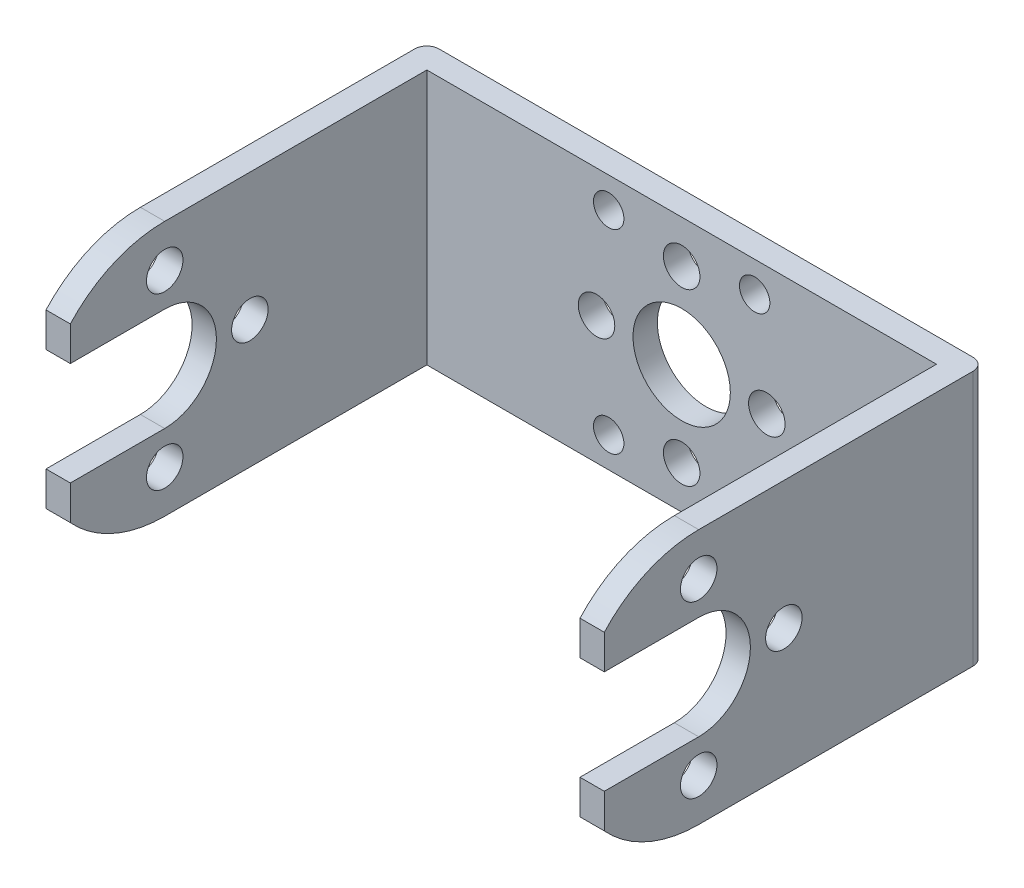
ISO-10303-21;
HEADER;
FILE_DESCRIPTION(('STEP AP214'),'2;1');
FILE_NAME('part.step','',(''),(''),'','','');
FILE_SCHEMA(('AUTOMOTIVE_DESIGN { 1 0 10303 214 1 1 1 1 }'));
ENDSEC;
DATA;
#1=APPLICATION_CONTEXT('core data for automotive mechanical design processes');
#2=APPLICATION_PROTOCOL_DEFINITION('international standard','automotive_design',2000,#1);
#3=PRODUCT_CONTEXT('',#1,'mechanical');
#4=PRODUCT('Part','Part','',(#3));
#5=PRODUCT_RELATED_PRODUCT_CATEGORY('part','',(#4));
#6=PRODUCT_DEFINITION_FORMATION('','',#4);
#7=PRODUCT_DEFINITION_CONTEXT('part definition',#1,'design');
#8=PRODUCT_DEFINITION('design','',#6,#7);
#9=PRODUCT_DEFINITION_SHAPE('','',#8);
#10=(LENGTH_UNIT() NAMED_UNIT(*) SI_UNIT(.MILLI.,.METRE.));
#11=(NAMED_UNIT(*) PLANE_ANGLE_UNIT() SI_UNIT($,.RADIAN.));
#12=(NAMED_UNIT(*) SI_UNIT($,.STERADIAN.) SOLID_ANGLE_UNIT());
#13=UNCERTAINTY_MEASURE_WITH_UNIT(LENGTH_MEASURE(1.E-05),#10,'distance_accuracy_value','');
#14=(GEOMETRIC_REPRESENTATION_CONTEXT(3) GLOBAL_UNCERTAINTY_ASSIGNED_CONTEXT((#13)) GLOBAL_UNIT_ASSIGNED_CONTEXT((#10,
#11,#12)) REPRESENTATION_CONTEXT('',''));
#15=CARTESIAN_POINT('',(0.,0.,0.));
#16=DIRECTION('',(0.,0.,1.));
#17=DIRECTION('',(1.,0.,0.));
#18=AXIS2_PLACEMENT_3D('',#15,#16,#17);
#19=CARTESIAN_POINT('',(-20.95,0.,31.31));
#20=DIRECTION('',(1.,0.,0.));
#21=DIRECTION('',(0.,0.,-1.));
#22=AXIS2_PLACEMENT_3D('',#19,#20,#21);
#23=PLANE('',#22);
#24=CARTESIAN_POINT('',(-20.95,0.,16.55));
#25=DIRECTION('',(1.,0.,0.));
#26=DIRECTION('',(0.,0.,-1.));
#27=AXIS2_PLACEMENT_3D('',#24,#25,#26);
#28=CIRCLE('',#27,1.5);
#29=CARTESIAN_POINT('',(-20.95,0.,15.05));
#30=VERTEX_POINT('',#29);
#31=EDGE_CURVE('E346',#30,#30,#28,.T.);
#32=ORIENTED_EDGE('',*,*,#31,.F.);
#33=EDGE_LOOP('',(#32));
#34=FACE_BOUND('',#33,.T.);
#35=CARTESIAN_POINT('',(-20.95,7.,23.55));
#36=DIRECTION('',(1.,0.,0.));
#37=DIRECTION('',(0.,0.,-1.));
#38=AXIS2_PLACEMENT_3D('',#35,#36,#37);
#39=CIRCLE('',#38,1.5);
#40=CARTESIAN_POINT('',(-20.95,7.,22.05));
#41=VERTEX_POINT('',#40);
#42=EDGE_CURVE('E339',#41,#41,#39,.T.);
#43=ORIENTED_EDGE('',*,*,#42,.F.);
#44=EDGE_LOOP('',(#43));
#45=FACE_BOUND('',#44,.T.);
#46=CARTESIAN_POINT('',(-20.95,-7.,23.55));
#47=DIRECTION('',(1.,0.,0.));
#48=DIRECTION('',(0.,0.,-1.));
#49=AXIS2_PLACEMENT_3D('',#46,#47,#48);
#50=CIRCLE('',#49,1.5);
#51=CARTESIAN_POINT('',(-20.95,-7.,22.05));
#52=VERTEX_POINT('',#51);
#53=EDGE_CURVE('E328',#52,#52,#50,.T.);
#54=ORIENTED_EDGE('',*,*,#53,.F.);
#55=EDGE_LOOP('',(#54));
#56=FACE_BOUND('',#55,.T.);
#57=DIRECTION('',(0.,0.,-1.));
#58=VECTOR('',#57,1.);
#59=CARTESIAN_POINT('',(-20.95,10.5,31.31));
#60=LINE('',#59,#58);
#61=CARTESIAN_POINT('',(-20.95,10.5,23.55));
#62=VERTEX_POINT('',#61);
#63=CARTESIAN_POINT('',(-20.95,10.5,2.));
#64=VERTEX_POINT('',#63);
#65=EDGE_CURVE('E380',#62,#64,#60,.T.);
#66=ORIENTED_EDGE('',*,*,#65,.F.);
#67=CARTESIAN_POINT('',(-20.95,0.,23.55));
#68=DIRECTION('',(1.,0.,0.));
#69=DIRECTION('',(0.,0.,-1.));
#70=AXIS2_PLACEMENT_3D('',#67,#68,#69);
#71=CIRCLE('',#70,10.5);
#72=CARTESIAN_POINT('',(-20.95,7.07335846681052,31.31));
#73=VERTEX_POINT('',#72);
#74=EDGE_CURVE('E321',#62,#73,#71,.T.);
#75=ORIENTED_EDGE('',*,*,#74,.T.);
#76=DIRECTION('',(0.,-1.,0.));
#77=VECTOR('',#76,1.);
#78=CARTESIAN_POINT('',(-20.95,0.,31.31));
#79=LINE('',#78,#77);
#80=CARTESIAN_POINT('',(-20.95,4.25,31.31));
#81=VERTEX_POINT('',#80);
#82=EDGE_CURVE('E368',#73,#81,#79,.T.);
#83=ORIENTED_EDGE('',*,*,#82,.T.);
#84=DIRECTION('',(0.,0.,-1.));
#85=VECTOR('',#84,1.);
#86=CARTESIAN_POINT('',(-20.95,4.25,31.31));
#87=LINE('',#86,#85);
#88=CARTESIAN_POINT('',(-20.95,4.25,23.55));
#89=VERTEX_POINT('',#88);
#90=EDGE_CURVE('E306',#81,#89,#87,.T.);
#91=ORIENTED_EDGE('',*,*,#90,.T.);
#92=CARTESIAN_POINT('',(-20.95,0.,23.55));
#93=DIRECTION('',(1.,0.,0.));
#94=DIRECTION('',(0.,0.,-1.));
#95=AXIS2_PLACEMENT_3D('',#92,#93,#94);
#96=CIRCLE('',#95,4.25);
#97=CARTESIAN_POINT('',(-20.95,-4.25,23.55));
#98=VERTEX_POINT('',#97);
#99=EDGE_CURVE('E240',#98,#89,#96,.T.);
#100=ORIENTED_EDGE('',*,*,#99,.F.);
#101=DIRECTION('',(0.,0.,-1.));
#102=VECTOR('',#101,1.);
#103=CARTESIAN_POINT('',(-20.95,-4.25,31.31));
#104=LINE('',#103,#102);
#105=CARTESIAN_POINT('',(-20.95,-4.25,31.31));
#106=VERTEX_POINT('',#105);
#107=EDGE_CURVE('E299',#106,#98,#104,.T.);
#108=ORIENTED_EDGE('',*,*,#107,.F.);
#109=CARTESIAN_POINT('',(-20.95,-7.07335846681052,31.31));
#110=VERTEX_POINT('',#109);
#111=EDGE_CURVE('E365',#106,#110,#79,.T.);
#112=ORIENTED_EDGE('',*,*,#111,.T.);
#113=CARTESIAN_POINT('',(-20.95,0.,23.55));
#114=DIRECTION('',(1.,0.,0.));
#115=DIRECTION('',(0.,0.,-1.));
#116=AXIS2_PLACEMENT_3D('',#113,#114,#115);
#117=CIRCLE('',#116,10.5);
#118=CARTESIAN_POINT('',(-20.95,-10.5,23.55));
#119=VERTEX_POINT('',#118);
#120=EDGE_CURVE('E313',#110,#119,#117,.T.);
#121=ORIENTED_EDGE('',*,*,#120,.T.);
#122=DIRECTION('',(0.,0.,-1.));
#123=VECTOR('',#122,1.);
#124=CARTESIAN_POINT('',(-20.95,-10.5,31.31));
#125=LINE('',#124,#123);
#126=CARTESIAN_POINT('',(-20.95,-10.5,2.));
#127=VERTEX_POINT('',#126);
#128=EDGE_CURVE('E373',#119,#127,#125,.T.);
#129=ORIENTED_EDGE('',*,*,#128,.T.);
#130=DIRECTION('',(0.,-1.,0.));
#131=VECTOR('',#130,1.);
#132=CARTESIAN_POINT('',(-20.95,0.,2.));
#133=LINE('',#132,#131);
#134=EDGE_CURVE('E414',#64,#127,#133,.T.);
#135=ORIENTED_EDGE('',*,*,#134,.F.);
#136=EDGE_LOOP('',(#66,#75,#83,#91,#100,#108,#112,#121,#129,#135));
#137=FACE_BOUND('',#136,.T.);
#138=ADVANCED_FACE('F79',(#34,#45,#56,#137),#23,.T.);
#139=CARTESIAN_POINT('',(-22.95,0.,31.31));
#140=DIRECTION('',(1.,0.,0.));
#141=DIRECTION('',(0.,0.,-1.));
#142=AXIS2_PLACEMENT_3D('',#139,#140,#141);
#143=PLANE('',#142);
#144=CARTESIAN_POINT('',(-22.95,0.,16.55));
#145=DIRECTION('',(-1.,0.,0.));
#146=DIRECTION('',(0.,0.,1.));
#147=AXIS2_PLACEMENT_3D('',#144,#145,#146);
#148=CIRCLE('',#147,1.5);
#149=CARTESIAN_POINT('',(-22.95,0.,18.05));
#150=VERTEX_POINT('',#149);
#151=EDGE_CURVE('E280',#150,#150,#148,.T.);
#152=ORIENTED_EDGE('',*,*,#151,.F.);
#153=EDGE_LOOP('',(#152));
#154=FACE_BOUND('',#153,.T.);
#155=CARTESIAN_POINT('',(-22.95,7.,23.55));
#156=DIRECTION('',(-1.,0.,0.));
#157=DIRECTION('',(0.,0.,1.));
#158=AXIS2_PLACEMENT_3D('',#155,#156,#157);
#159=CIRCLE('',#158,1.5);
#160=CARTESIAN_POINT('',(-22.95,7.,25.05));
#161=VERTEX_POINT('',#160);
#162=EDGE_CURVE('E286',#161,#161,#159,.T.);
#163=ORIENTED_EDGE('',*,*,#162,.F.);
#164=EDGE_LOOP('',(#163));
#165=FACE_BOUND('',#164,.T.);
#166=CARTESIAN_POINT('',(-22.95,-7.,23.55));
#167=DIRECTION('',(-1.,0.,0.));
#168=DIRECTION('',(0.,0.,1.));
#169=AXIS2_PLACEMENT_3D('',#166,#167,#168);
#170=CIRCLE('',#169,1.5);
#171=CARTESIAN_POINT('',(-22.95,-7.,25.05));
#172=VERTEX_POINT('',#171);
#173=EDGE_CURVE('E289',#172,#172,#170,.T.);
#174=ORIENTED_EDGE('',*,*,#173,.F.);
#175=EDGE_LOOP('',(#174));
#176=FACE_BOUND('',#175,.T.);
#177=DIRECTION('',(0.,0.,-1.));
#178=VECTOR('',#177,1.);
#179=CARTESIAN_POINT('',(-22.95,10.5,31.31));
#180=LINE('',#179,#178);
#181=CARTESIAN_POINT('',(-22.95,10.5,23.55));
#182=VERTEX_POINT('',#181);
#183=CARTESIAN_POINT('',(-22.95,10.5,1.));
#184=VERTEX_POINT('',#183);
#185=EDGE_CURVE('E378',#182,#184,#180,.T.);
#186=ORIENTED_EDGE('',*,*,#185,.T.);
#187=DIRECTION('',(0.,-1.,0.));
#188=VECTOR('',#187,1.);
#189=CARTESIAN_POINT('',(-22.95,0.,1.));
#190=LINE('',#189,#188);
#191=CARTESIAN_POINT('',(-22.95,-10.5,1.));
#192=VERTEX_POINT('',#191);
#193=EDGE_CURVE('E12',#184,#192,#190,.T.);
#194=ORIENTED_EDGE('',*,*,#193,.T.);
#195=DIRECTION('',(0.,0.,-1.));
#196=VECTOR('',#195,1.);
#197=CARTESIAN_POINT('',(-22.95,-10.5,31.31));
#198=LINE('',#197,#196);
#199=CARTESIAN_POINT('',(-22.95,-10.5,23.55));
#200=VERTEX_POINT('',#199);
#201=EDGE_CURVE('E375',#200,#192,#198,.T.);
#202=ORIENTED_EDGE('',*,*,#201,.F.);
#203=CARTESIAN_POINT('',(-22.95,0.,23.55));
#204=DIRECTION('',(-1.,0.,0.));
#205=DIRECTION('',(0.,0.,1.));
#206=AXIS2_PLACEMENT_3D('',#203,#204,#205);
#207=CIRCLE('',#206,10.5);
#208=CARTESIAN_POINT('',(-22.95,-7.07335846681052,31.31));
#209=VERTEX_POINT('',#208);
#210=EDGE_CURVE('E277',#200,#209,#207,.T.);
#211=ORIENTED_EDGE('',*,*,#210,.T.);
#212=DIRECTION('',(0.,-1.,0.));
#213=VECTOR('',#212,1.);
#214=CARTESIAN_POINT('',(-22.95,0.,31.31));
#215=LINE('',#214,#213);
#216=CARTESIAN_POINT('',(-22.95,-4.25,31.31));
#217=VERTEX_POINT('',#216);
#218=EDGE_CURVE('E369',#217,#209,#215,.T.);
#219=ORIENTED_EDGE('',*,*,#218,.F.);
#220=DIRECTION('',(0.,0.,1.));
#221=VECTOR('',#220,1.);
#222=CARTESIAN_POINT('',(-22.95,-4.25,0.));
#223=LINE('',#222,#221);
#224=CARTESIAN_POINT('',(-22.95,-4.25,23.55));
#225=VERTEX_POINT('',#224);
#226=EDGE_CURVE('E253',#225,#217,#223,.T.);
#227=ORIENTED_EDGE('',*,*,#226,.F.);
#228=CARTESIAN_POINT('',(-22.95,0.,23.55));
#229=DIRECTION('',(-1.,0.,0.));
#230=DIRECTION('',(0.,0.,1.));
#231=AXIS2_PLACEMENT_3D('',#228,#229,#230);
#232=CIRCLE('',#231,4.25);
#233=CARTESIAN_POINT('',(-22.95,4.25,23.55));
#234=VERTEX_POINT('',#233);
#235=EDGE_CURVE('E237',#234,#225,#232,.T.);
#236=ORIENTED_EDGE('',*,*,#235,.F.);
#237=DIRECTION('',(0.,0.,1.));
#238=VECTOR('',#237,1.);
#239=CARTESIAN_POINT('',(-22.95,4.25,0.));
#240=LINE('',#239,#238);
#241=CARTESIAN_POINT('',(-22.95,4.25,31.31));
#242=VERTEX_POINT('',#241);
#243=EDGE_CURVE('E246',#234,#242,#240,.T.);
#244=ORIENTED_EDGE('',*,*,#243,.T.);
#245=CARTESIAN_POINT('',(-22.95,7.07335846681052,31.31));
#246=VERTEX_POINT('',#245);
#247=EDGE_CURVE('E372',#246,#242,#215,.T.);
#248=ORIENTED_EDGE('',*,*,#247,.F.);
#249=CARTESIAN_POINT('',(-22.95,0.,23.55));
#250=DIRECTION('',(-1.,0.,0.));
#251=DIRECTION('',(0.,0.,1.));
#252=AXIS2_PLACEMENT_3D('',#249,#250,#251);
#253=CIRCLE('',#252,10.5);
#254=EDGE_CURVE('E276',#246,#182,#253,.T.);
#255=ORIENTED_EDGE('',*,*,#254,.T.);
#256=EDGE_LOOP('',(#186,#194,#202,#211,#219,#227,#236,#244,#248,#255));
#257=FACE_BOUND('',#256,.T.);
#258=ADVANCED_FACE('F256',(#154,#165,#176,#257),#143,.F.);
#259=CARTESIAN_POINT('',(0.,0.,31.31));
#260=DIRECTION('',(0.,0.,1.));
#261=DIRECTION('',(1.,0.,0.));
#262=AXIS2_PLACEMENT_3D('',#259,#260,#261);
#263=PLANE('',#262);
#264=ORIENTED_EDGE('',*,*,#82,.F.);
#265=DIRECTION('',(-1.,0.,0.));
#266=VECTOR('',#265,1.);
#267=CARTESIAN_POINT('',(27.05,7.07335846681052,31.31));
#268=LINE('',#267,#266);
#269=EDGE_CURVE('E281',#73,#246,#268,.T.);
#270=ORIENTED_EDGE('',*,*,#269,.T.);
#271=ORIENTED_EDGE('',*,*,#247,.T.);
#272=DIRECTION('',(-1.,0.,0.));
#273=VECTOR('',#272,1.);
#274=CARTESIAN_POINT('',(27.05,4.25,31.31));
#275=LINE('',#274,#273);
#276=EDGE_CURVE('E249',#81,#242,#275,.T.);
#277=ORIENTED_EDGE('',*,*,#276,.F.);
#278=EDGE_LOOP('',(#264,#270,#271,#277));
#279=FACE_BOUND('',#278,.T.);
#280=ADVANCED_FACE('F540',(#279),#263,.T.);
#281=ORIENTED_EDGE('',*,*,#218,.T.);
#282=DIRECTION('',(-1.,0.,0.));
#283=VECTOR('',#282,1.);
#284=CARTESIAN_POINT('',(27.05,-7.07335846681052,31.31));
#285=LINE('',#284,#283);
#286=EDGE_CURVE('E274',#110,#209,#285,.T.);
#287=ORIENTED_EDGE('',*,*,#286,.F.);
#288=ORIENTED_EDGE('',*,*,#111,.F.);
#289=DIRECTION('',(-1.,0.,0.));
#290=VECTOR('',#289,1.);
#291=CARTESIAN_POINT('',(27.05,-4.25,31.31));
#292=LINE('',#291,#290);
#293=EDGE_CURVE('E266',#106,#217,#292,.T.);
#294=ORIENTED_EDGE('',*,*,#293,.T.);
#295=EDGE_LOOP('',(#281,#287,#288,#294));
#296=FACE_BOUND('',#295,.T.);
#297=ADVANCED_FACE('F861',(#296),#263,.T.);
#298=CARTESIAN_POINT('',(20.95,0.,31.31));
#299=DIRECTION('',(1.,0.,0.));
#300=DIRECTION('',(0.,0.,-1.));
#301=AXIS2_PLACEMENT_3D('',#298,#299,#300);
#302=PLANE('',#301);
#303=CARTESIAN_POINT('',(20.95,0.,16.55));
#304=DIRECTION('',(1.,0.,0.));
#305=DIRECTION('',(0.,0.,-1.));
#306=AXIS2_PLACEMENT_3D('',#303,#304,#305);
#307=CIRCLE('',#306,1.5);
#308=CARTESIAN_POINT('',(20.95,0.,15.05));
#309=VERTEX_POINT('',#308);
#310=EDGE_CURVE('E343',#309,#309,#307,.T.);
#311=ORIENTED_EDGE('',*,*,#310,.T.);
#312=EDGE_LOOP('',(#311));
#313=FACE_BOUND('',#312,.T.);
#314=CARTESIAN_POINT('',(20.95,7.,23.55));
#315=DIRECTION('',(1.,0.,0.));
#316=DIRECTION('',(0.,0.,-1.));
#317=AXIS2_PLACEMENT_3D('',#314,#315,#316);
#318=CIRCLE('',#317,1.5);
#319=CARTESIAN_POINT('',(20.95,7.,22.05));
#320=VERTEX_POINT('',#319);
#321=EDGE_CURVE('E336',#320,#320,#318,.T.);
#322=ORIENTED_EDGE('',*,*,#321,.T.);
#323=EDGE_LOOP('',(#322));
#324=FACE_BOUND('',#323,.T.);
#325=CARTESIAN_POINT('',(20.95,-7.,23.55));
#326=DIRECTION('',(1.,0.,0.));
#327=DIRECTION('',(0.,0.,-1.));
#328=AXIS2_PLACEMENT_3D('',#325,#326,#327);
#329=CIRCLE('',#328,1.5);
#330=CARTESIAN_POINT('',(20.95,-7.,22.05));
#331=VERTEX_POINT('',#330);
#332=EDGE_CURVE('E325',#331,#331,#329,.T.);
#333=ORIENTED_EDGE('',*,*,#332,.T.);
#334=EDGE_LOOP('',(#333));
#335=FACE_BOUND('',#334,.T.);
#336=CARTESIAN_POINT('',(20.95,0.,23.55));
#337=DIRECTION('',(1.,0.,0.));
#338=DIRECTION('',(0.,0.,-1.));
#339=AXIS2_PLACEMENT_3D('',#336,#337,#338);
#340=CIRCLE('',#339,10.5);
#341=CARTESIAN_POINT('',(20.95,10.5,23.55));
#342=VERTEX_POINT('',#341);
#343=CARTESIAN_POINT('',(20.95,7.07335846681052,31.31));
#344=VERTEX_POINT('',#343);
#345=EDGE_CURVE('E319',#342,#344,#340,.T.);
#346=ORIENTED_EDGE('',*,*,#345,.F.);
#347=DIRECTION('',(0.,0.,-1.));
#348=VECTOR('',#347,1.);
#349=CARTESIAN_POINT('',(20.95,10.5,31.31));
#350=LINE('',#349,#348);
#351=CARTESIAN_POINT('',(20.95,10.5,2.));
#352=VERTEX_POINT('',#351);
#353=EDGE_CURVE('E363',#342,#352,#350,.T.);
#354=ORIENTED_EDGE('',*,*,#353,.T.);
#355=DIRECTION('',(0.,-1.,0.));
#356=VECTOR('',#355,1.);
#357=CARTESIAN_POINT('',(20.95,0.,2.));
#358=LINE('',#357,#356);
#359=CARTESIAN_POINT('',(20.95,-10.5,2.));
#360=VERTEX_POINT('',#359);
#361=EDGE_CURVE('E408',#352,#360,#358,.T.);
#362=ORIENTED_EDGE('',*,*,#361,.T.);
#363=DIRECTION('',(0.,0.,-1.));
#364=VECTOR('',#363,1.);
#365=CARTESIAN_POINT('',(20.95,-10.5,31.31));
#366=LINE('',#365,#364);
#367=CARTESIAN_POINT('',(20.95,-10.5,23.55));
#368=VERTEX_POINT('',#367);
#369=EDGE_CURVE('E361',#368,#360,#366,.T.);
#370=ORIENTED_EDGE('',*,*,#369,.F.);
#371=CARTESIAN_POINT('',(20.95,0.,23.55));
#372=DIRECTION('',(1.,0.,0.));
#373=DIRECTION('',(0.,0.,-1.));
#374=AXIS2_PLACEMENT_3D('',#371,#372,#373);
#375=CIRCLE('',#374,10.5);
#376=CARTESIAN_POINT('',(20.95,-7.07335846681052,31.31));
#377=VERTEX_POINT('',#376);
#378=EDGE_CURVE('E311',#377,#368,#375,.T.);
#379=ORIENTED_EDGE('',*,*,#378,.F.);
#380=DIRECTION('',(0.,-1.,0.));
#381=VECTOR('',#380,1.);
#382=CARTESIAN_POINT('',(20.95,0.,31.31));
#383=LINE('',#382,#381);
#384=CARTESIAN_POINT('',(20.95,-4.25,31.31));
#385=VERTEX_POINT('',#384);
#386=EDGE_CURVE('E349',#385,#377,#383,.T.);
#387=ORIENTED_EDGE('',*,*,#386,.F.);
#388=DIRECTION('',(0.,0.,-1.));
#389=VECTOR('',#388,1.);
#390=CARTESIAN_POINT('',(20.95,-4.25,31.31));
#391=LINE('',#390,#389);
#392=CARTESIAN_POINT('',(20.95,-4.25,23.55));
#393=VERTEX_POINT('',#392);
#394=EDGE_CURVE('E296',#385,#393,#391,.T.);
#395=ORIENTED_EDGE('',*,*,#394,.T.);
#396=CARTESIAN_POINT('',(20.95,0.,23.55));
#397=DIRECTION('',(1.,0.,0.));
#398=DIRECTION('',(0.,0.,-1.));
#399=AXIS2_PLACEMENT_3D('',#396,#397,#398);
#400=CIRCLE('',#399,4.25);
#401=CARTESIAN_POINT('',(20.95,4.25,23.55));
#402=VERTEX_POINT('',#401);
#403=EDGE_CURVE('E331',#393,#402,#400,.T.);
#404=ORIENTED_EDGE('',*,*,#403,.T.);
#405=DIRECTION('',(0.,0.,-1.));
#406=VECTOR('',#405,1.);
#407=CARTESIAN_POINT('',(20.95,4.25,31.31));
#408=LINE('',#407,#406);
#409=CARTESIAN_POINT('',(20.95,4.25,31.31));
#410=VERTEX_POINT('',#409);
#411=EDGE_CURVE('E304',#410,#402,#408,.T.);
#412=ORIENTED_EDGE('',*,*,#411,.F.);
#413=EDGE_CURVE('E352',#344,#410,#383,.T.);
#414=ORIENTED_EDGE('',*,*,#413,.F.);
#415=EDGE_LOOP('',(#346,#354,#362,#370,#379,#387,#395,#404,#412,#414));
#416=FACE_BOUND('',#415,.T.);
#417=ADVANCED_FACE('F510',(#313,#324,#335,#416),#302,.F.);
#418=CARTESIAN_POINT('',(22.95,0.,31.31));
#419=DIRECTION('',(1.,0.,0.));
#420=DIRECTION('',(0.,0.,-1.));
#421=AXIS2_PLACEMENT_3D('',#418,#419,#420);
#422=PLANE('',#421);
#423=CARTESIAN_POINT('',(22.95,0.,16.55));
#424=DIRECTION('',(1.,0.,0.));
#425=DIRECTION('',(0.,0.,-1.));
#426=AXIS2_PLACEMENT_3D('',#423,#424,#425);
#427=CIRCLE('',#426,1.5);
#428=CARTESIAN_POINT('',(22.95,0.,15.05));
#429=VERTEX_POINT('',#428);
#430=EDGE_CURVE('E342',#429,#429,#427,.T.);
#431=ORIENTED_EDGE('',*,*,#430,.F.);
#432=EDGE_LOOP('',(#431));
#433=FACE_BOUND('',#432,.T.);
#434=CARTESIAN_POINT('',(22.95,7.,23.55));
#435=DIRECTION('',(1.,0.,0.));
#436=DIRECTION('',(0.,0.,-1.));
#437=AXIS2_PLACEMENT_3D('',#434,#435,#436);
#438=CIRCLE('',#437,1.5);
#439=CARTESIAN_POINT('',(22.95,7.,22.05));
#440=VERTEX_POINT('',#439);
#441=EDGE_CURVE('E335',#440,#440,#438,.T.);
#442=ORIENTED_EDGE('',*,*,#441,.F.);
#443=EDGE_LOOP('',(#442));
#444=FACE_BOUND('',#443,.T.);
#445=CARTESIAN_POINT('',(22.95,-7.,23.55));
#446=DIRECTION('',(1.,0.,0.));
#447=DIRECTION('',(0.,0.,-1.));
#448=AXIS2_PLACEMENT_3D('',#445,#446,#447);
#449=CIRCLE('',#448,1.5);
#450=CARTESIAN_POINT('',(22.95,-7.,22.05));
#451=VERTEX_POINT('',#450);
#452=EDGE_CURVE('E324',#451,#451,#449,.T.);
#453=ORIENTED_EDGE('',*,*,#452,.F.);
#454=EDGE_LOOP('',(#453));
#455=FACE_BOUND('',#454,.T.);
#456=DIRECTION('',(0.,0.,-1.));
#457=VECTOR('',#456,1.);
#458=CARTESIAN_POINT('',(22.95,-10.5,31.31));
#459=LINE('',#458,#457);
#460=CARTESIAN_POINT('',(22.95,-10.5,23.55));
#461=VERTEX_POINT('',#460);
#462=CARTESIAN_POINT('',(22.95,-10.5,1.));
#463=VERTEX_POINT('',#462);
#464=EDGE_CURVE('E359',#461,#463,#459,.T.);
#465=ORIENTED_EDGE('',*,*,#464,.T.);
#466=DIRECTION('',(0.,-1.,0.));
#467=VECTOR('',#466,1.);
#468=CARTESIAN_POINT('',(22.95,10.5,1.));
#469=LINE('',#468,#467);
#470=CARTESIAN_POINT('',(22.95,10.5,1.));
#471=VERTEX_POINT('',#470);
#472=EDGE_CURVE('E102',#463,#471,#469,.F.);
#473=ORIENTED_EDGE('',*,*,#472,.T.);
#474=DIRECTION('',(0.,0.,-1.));
#475=VECTOR('',#474,1.);
#476=CARTESIAN_POINT('',(22.95,10.5,31.31));
#477=LINE('',#476,#475);
#478=CARTESIAN_POINT('',(22.95,10.5,23.55));
#479=VERTEX_POINT('',#478);
#480=EDGE_CURVE('E357',#479,#471,#477,.T.);
#481=ORIENTED_EDGE('',*,*,#480,.F.);
#482=CARTESIAN_POINT('',(22.95,0.,23.55));
#483=DIRECTION('',(1.,0.,0.));
#484=DIRECTION('',(0.,0.,-1.));
#485=AXIS2_PLACEMENT_3D('',#482,#483,#484);
#486=CIRCLE('',#485,10.5);
#487=CARTESIAN_POINT('',(22.95,7.07335846681052,31.31));
#488=VERTEX_POINT('',#487);
#489=EDGE_CURVE('E316',#479,#488,#486,.T.);
#490=ORIENTED_EDGE('',*,*,#489,.T.);
#491=DIRECTION('',(0.,-1.,0.));
#492=VECTOR('',#491,1.);
#493=CARTESIAN_POINT('',(22.95,0.,31.31));
#494=LINE('',#493,#492);
#495=CARTESIAN_POINT('',(22.95,4.25,31.31));
#496=VERTEX_POINT('',#495);
#497=EDGE_CURVE('E356',#488,#496,#494,.T.);
#498=ORIENTED_EDGE('',*,*,#497,.T.);
#499=DIRECTION('',(0.,0.,-1.));
#500=VECTOR('',#499,1.);
#501=CARTESIAN_POINT('',(22.95,4.25,31.31));
#502=LINE('',#501,#500);
#503=CARTESIAN_POINT('',(22.95,4.25,23.55));
#504=VERTEX_POINT('',#503);
#505=EDGE_CURVE('E301',#496,#504,#502,.T.);
#506=ORIENTED_EDGE('',*,*,#505,.T.);
#507=CARTESIAN_POINT('',(22.95,0.,23.55));
#508=DIRECTION('',(1.,0.,0.));
#509=DIRECTION('',(0.,0.,-1.));
#510=AXIS2_PLACEMENT_3D('',#507,#508,#509);
#511=CIRCLE('',#510,4.25);
#512=CARTESIAN_POINT('',(22.95,-4.25,23.55));
#513=VERTEX_POINT('',#512);
#514=EDGE_CURVE('E465',#513,#504,#511,.T.);
#515=ORIENTED_EDGE('',*,*,#514,.F.);
#516=DIRECTION('',(0.,0.,-1.));
#517=VECTOR('',#516,1.);
#518=CARTESIAN_POINT('',(22.95,-4.25,31.31));
#519=LINE('',#518,#517);
#520=CARTESIAN_POINT('',(22.95,-4.25,31.31));
#521=VERTEX_POINT('',#520);
#522=EDGE_CURVE('E294',#521,#513,#519,.T.);
#523=ORIENTED_EDGE('',*,*,#522,.F.);
#524=CARTESIAN_POINT('',(22.95,-7.07335846681052,31.31));
#525=VERTEX_POINT('',#524);
#526=EDGE_CURVE('E353',#521,#525,#494,.T.);
#527=ORIENTED_EDGE('',*,*,#526,.T.);
#528=CARTESIAN_POINT('',(22.95,0.,23.55));
#529=DIRECTION('',(1.,0.,0.));
#530=DIRECTION('',(0.,0.,-1.));
#531=AXIS2_PLACEMENT_3D('',#528,#529,#530);
#532=CIRCLE('',#531,10.5);
#533=EDGE_CURVE('E308',#525,#461,#532,.T.);
#534=ORIENTED_EDGE('',*,*,#533,.T.);
#535=EDGE_LOOP('',(#465,#473,#481,#490,#498,#506,#515,#523,#527,#534));
#536=FACE_BOUND('',#535,.T.);
#537=ADVANCED_FACE('F498',(#433,#444,#455,#536),#422,.T.);
#538=CARTESIAN_POINT('',(0.,0.,31.31));
#539=DIRECTION('',(0.,0.,1.));
#540=DIRECTION('',(1.,0.,0.));
#541=AXIS2_PLACEMENT_3D('',#538,#539,#540);
#542=PLANE('',#541);
#543=ORIENTED_EDGE('',*,*,#497,.F.);
#544=DIRECTION('',(-1.,0.,0.));
#545=VECTOR('',#544,1.);
#546=CARTESIAN_POINT('',(27.05,7.07335846681052,31.31));
#547=LINE('',#546,#545);
#548=EDGE_CURVE('E462',#488,#344,#547,.T.);
#549=ORIENTED_EDGE('',*,*,#548,.T.);
#550=ORIENTED_EDGE('',*,*,#413,.T.);
#551=DIRECTION('',(1.,0.,0.));
#552=VECTOR('',#551,1.);
#553=CARTESIAN_POINT('',(0.,4.25,31.31));
#554=LINE('',#553,#552);
#555=EDGE_CURVE('E456',#410,#496,#554,.T.);
#556=ORIENTED_EDGE('',*,*,#555,.T.);
#557=EDGE_LOOP('',(#543,#549,#550,#556));
#558=FACE_BOUND('',#557,.T.);
#559=ADVANCED_FACE('F890',(#558),#542,.T.);
#560=ORIENTED_EDGE('',*,*,#386,.T.);
#561=DIRECTION('',(-1.,0.,0.));
#562=VECTOR('',#561,1.);
#563=CARTESIAN_POINT('',(27.05,-7.07335846681052,31.31));
#564=LINE('',#563,#562);
#565=EDGE_CURVE('E459',#377,#525,#564,.F.);
#566=ORIENTED_EDGE('',*,*,#565,.T.);
#567=ORIENTED_EDGE('',*,*,#526,.F.);
#568=DIRECTION('',(1.,0.,0.));
#569=VECTOR('',#568,1.);
#570=CARTESIAN_POINT('',(0.,-4.25,31.31));
#571=LINE('',#570,#569);
#572=EDGE_CURVE('E423',#385,#521,#571,.T.);
#573=ORIENTED_EDGE('',*,*,#572,.F.);
#574=EDGE_LOOP('',(#560,#566,#567,#573));
#575=FACE_BOUND('',#574,.T.);
#576=ADVANCED_FACE('F505',(#575),#542,.T.);
#577=CARTESIAN_POINT('',(0.,10.5,2.));
#578=DIRECTION('',(0.,1.,0.));
#579=DIRECTION('',(0.,0.,1.));
#580=AXIS2_PLACEMENT_3D('',#577,#578,#579);
#581=PLANE('',#580);
#582=ORIENTED_EDGE('',*,*,#480,.T.);
#583=CARTESIAN_POINT('',(21.95,10.5,1.));
#584=DIRECTION('',(0.,1.,0.));
#585=DIRECTION('',(0.,0.,1.));
#586=AXIS2_PLACEMENT_3D('',#583,#584,#585);
#587=CIRCLE('',#586,1.);
#588=CARTESIAN_POINT('',(21.95,10.5,0.));
#589=VERTEX_POINT('',#588);
#590=EDGE_CURVE('E87',#471,#589,#587,.T.);
#591=ORIENTED_EDGE('',*,*,#590,.T.);
#592=DIRECTION('',(1.,0.,0.));
#593=VECTOR('',#592,1.);
#594=CARTESIAN_POINT('',(0.,10.5,0.));
#595=LINE('',#594,#593);
#596=CARTESIAN_POINT('',(-21.95,10.5,0.));
#597=VERTEX_POINT('',#596);
#598=EDGE_CURVE('E447',#597,#589,#595,.T.);
#599=ORIENTED_EDGE('',*,*,#598,.F.);
#600=CARTESIAN_POINT('',(-21.95,10.5,1.));
#601=DIRECTION('',(0.,1.,0.));
#602=DIRECTION('',(0.,0.,1.));
#603=AXIS2_PLACEMENT_3D('',#600,#601,#602);
#604=CIRCLE('',#603,1.);
#605=EDGE_CURVE('E94',#597,#184,#604,.T.);
#606=ORIENTED_EDGE('',*,*,#605,.T.);
#607=ORIENTED_EDGE('',*,*,#185,.F.);
#608=DIRECTION('',(-1.,0.,0.));
#609=VECTOR('',#608,1.);
#610=CARTESIAN_POINT('',(27.05,10.5,23.55));
#611=LINE('',#610,#609);
#612=EDGE_CURVE('E258',#62,#182,#611,.T.);
#613=ORIENTED_EDGE('',*,*,#612,.F.);
#614=ORIENTED_EDGE('',*,*,#65,.T.);
#615=DIRECTION('',(1.,0.,0.));
#616=VECTOR('',#615,1.);
#617=CARTESIAN_POINT('',(0.,10.5,2.));
#618=LINE('',#617,#616);
#619=EDGE_CURVE('E411',#64,#352,#618,.T.);
#620=ORIENTED_EDGE('',*,*,#619,.T.);
#621=ORIENTED_EDGE('',*,*,#353,.F.);
#622=EDGE_CURVE('E260',#479,#342,#611,.T.);
#623=ORIENTED_EDGE('',*,*,#622,.F.);
#624=EDGE_LOOP('',(#582,#591,#599,#606,#607,#613,#614,#620,#621,#623));
#625=FACE_BOUND('',#624,.T.);
#626=ADVANCED_FACE('F484',(#625),#581,.T.);
#627=CARTESIAN_POINT('',(0.,-10.5,2.));
#628=DIRECTION('',(0.,1.,0.));
#629=DIRECTION('',(0.,0.,1.));
#630=AXIS2_PLACEMENT_3D('',#627,#628,#629);
#631=PLANE('',#630);
#632=DIRECTION('',(1.,0.,0.));
#633=VECTOR('',#632,1.);
#634=CARTESIAN_POINT('',(0.,-10.5,0.));
#635=LINE('',#634,#633);
#636=CARTESIAN_POINT('',(-21.95,-10.5,0.));
#637=VERTEX_POINT('',#636);
#638=CARTESIAN_POINT('',(21.95,-10.5,0.));
#639=VERTEX_POINT('',#638);
#640=EDGE_CURVE('E450',#637,#639,#635,.T.);
#641=ORIENTED_EDGE('',*,*,#640,.T.);
#642=CARTESIAN_POINT('',(21.95,-10.5,1.));
#643=DIRECTION('',(0.,1.,0.));
#644=DIRECTION('',(0.,0.,1.));
#645=AXIS2_PLACEMENT_3D('',#642,#643,#644);
#646=CIRCLE('',#645,1.);
#647=EDGE_CURVE('E480',#639,#463,#646,.F.);
#648=ORIENTED_EDGE('',*,*,#647,.T.);
#649=ORIENTED_EDGE('',*,*,#464,.F.);
#650=DIRECTION('',(-1.,0.,0.));
#651=VECTOR('',#650,1.);
#652=CARTESIAN_POINT('',(27.05,-10.5,23.55));
#653=LINE('',#652,#651);
#654=EDGE_CURVE('E273',#461,#368,#653,.T.);
#655=ORIENTED_EDGE('',*,*,#654,.T.);
#656=ORIENTED_EDGE('',*,*,#369,.T.);
#657=DIRECTION('',(1.,0.,0.));
#658=VECTOR('',#657,1.);
#659=CARTESIAN_POINT('',(0.,-10.5,2.));
#660=LINE('',#659,#658);
#661=EDGE_CURVE('E417',#127,#360,#660,.T.);
#662=ORIENTED_EDGE('',*,*,#661,.F.);
#663=ORIENTED_EDGE('',*,*,#128,.F.);
#664=EDGE_CURVE('E270',#119,#200,#653,.T.);
#665=ORIENTED_EDGE('',*,*,#664,.T.);
#666=ORIENTED_EDGE('',*,*,#201,.T.);
#667=CARTESIAN_POINT('',(-21.95,-10.5,1.));
#668=DIRECTION('',(0.,1.,0.));
#669=DIRECTION('',(0.,0.,1.));
#670=AXIS2_PLACEMENT_3D('',#667,#668,#669);
#671=CIRCLE('',#670,1.);
#672=EDGE_CURVE('E478',#192,#637,#671,.F.);
#673=ORIENTED_EDGE('',*,*,#672,.T.);
#674=EDGE_LOOP('',(#641,#648,#649,#655,#656,#662,#663,#665,#666,#673));
#675=FACE_BOUND('',#674,.T.);
#676=ADVANCED_FACE('F496',(#675),#631,.F.);
#677=CARTESIAN_POINT('',(-6.,8.,2.));
#678=DIRECTION('',(0.,0.,-1.));
#679=DIRECTION('',(-1.,0.,0.));
#680=AXIS2_PLACEMENT_3D('',#677,#678,#679);
#681=CYLINDRICAL_SURFACE('',#680,1.25);
#682=CARTESIAN_POINT('',(-6.,8.,2.));
#683=DIRECTION('',(0.,0.,1.));
#684=DIRECTION('',(1.,0.,0.));
#685=AXIS2_PLACEMENT_3D('',#682,#683,#684);
#686=CIRCLE('',#685,1.25);
#687=CARTESIAN_POINT('',(-4.75,8.,2.));
#688=VERTEX_POINT('',#687);
#689=EDGE_CURVE('E405',#688,#688,#686,.T.);
#690=ORIENTED_EDGE('',*,*,#689,.T.);
#691=EDGE_LOOP('',(#690));
#692=FACE_BOUND('',#691,.T.);
#693=CARTESIAN_POINT('',(-6.,8.,0.));
#694=DIRECTION('',(0.,0.,1.));
#695=DIRECTION('',(1.,0.,0.));
#696=AXIS2_PLACEMENT_3D('',#693,#694,#695);
#697=CIRCLE('',#696,1.25);
#698=CARTESIAN_POINT('',(-4.75,8.,0.));
#699=VERTEX_POINT('',#698);
#700=EDGE_CURVE('E444',#699,#699,#697,.T.);
#701=ORIENTED_EDGE('',*,*,#700,.F.);
#702=EDGE_LOOP('',(#701));
#703=FACE_BOUND('',#702,.T.);
#704=ADVANCED_FACE('F561',(#692,#703),#681,.F.);
#705=CARTESIAN_POINT('',(6.,8.,2.));
#706=DIRECTION('',(0.,0.,-1.));
#707=DIRECTION('',(-1.,0.,0.));
#708=AXIS2_PLACEMENT_3D('',#705,#706,#707);
#709=CYLINDRICAL_SURFACE('',#708,1.25);
#710=CARTESIAN_POINT('',(6.,8.,2.));
#711=DIRECTION('',(0.,0.,1.));
#712=DIRECTION('',(1.,0.,0.));
#713=AXIS2_PLACEMENT_3D('',#710,#711,#712);
#714=CIRCLE('',#713,1.25);
#715=CARTESIAN_POINT('',(7.25,8.,2.));
#716=VERTEX_POINT('',#715);
#717=EDGE_CURVE('E402',#716,#716,#714,.T.);
#718=ORIENTED_EDGE('',*,*,#717,.T.);
#719=EDGE_LOOP('',(#718));
#720=FACE_BOUND('',#719,.T.);
#721=CARTESIAN_POINT('',(6.,8.,0.));
#722=DIRECTION('',(0.,0.,1.));
#723=DIRECTION('',(1.,0.,0.));
#724=AXIS2_PLACEMENT_3D('',#721,#722,#723);
#725=CIRCLE('',#724,1.25);
#726=CARTESIAN_POINT('',(7.25,8.,0.));
#727=VERTEX_POINT('',#726);
#728=EDGE_CURVE('E441',#727,#727,#725,.T.);
#729=ORIENTED_EDGE('',*,*,#728,.F.);
#730=EDGE_LOOP('',(#729));
#731=FACE_BOUND('',#730,.T.);
#732=ADVANCED_FACE('F566',(#720,#731),#709,.F.);
#733=CARTESIAN_POINT('',(-6.,-8.,2.));
#734=DIRECTION('',(0.,0.,-1.));
#735=DIRECTION('',(-1.,0.,0.));
#736=AXIS2_PLACEMENT_3D('',#733,#734,#735);
#737=CYLINDRICAL_SURFACE('',#736,1.25);
#738=CARTESIAN_POINT('',(-6.,-8.,2.));
#739=DIRECTION('',(0.,0.,1.));
#740=DIRECTION('',(1.,0.,0.));
#741=AXIS2_PLACEMENT_3D('',#738,#739,#740);
#742=CIRCLE('',#741,1.25);
#743=CARTESIAN_POINT('',(-4.75,-8.,2.));
#744=VERTEX_POINT('',#743);
#745=EDGE_CURVE('E399',#744,#744,#742,.T.);
#746=ORIENTED_EDGE('',*,*,#745,.T.);
#747=EDGE_LOOP('',(#746));
#748=FACE_BOUND('',#747,.T.);
#749=CARTESIAN_POINT('',(-6.,-8.,0.));
#750=DIRECTION('',(0.,0.,1.));
#751=DIRECTION('',(1.,0.,0.));
#752=AXIS2_PLACEMENT_3D('',#749,#750,#751);
#753=CIRCLE('',#752,1.25);
#754=CARTESIAN_POINT('',(-4.75,-8.,0.));
#755=VERTEX_POINT('',#754);
#756=EDGE_CURVE('E438',#755,#755,#753,.T.);
#757=ORIENTED_EDGE('',*,*,#756,.F.);
#758=EDGE_LOOP('',(#757));
#759=FACE_BOUND('',#758,.T.);
#760=ADVANCED_FACE('F570',(#748,#759),#737,.F.);
#761=CARTESIAN_POINT('',(6.,-8.,2.));
#762=DIRECTION('',(0.,0.,-1.));
#763=DIRECTION('',(-1.,0.,0.));
#764=AXIS2_PLACEMENT_3D('',#761,#762,#763);
#765=CYLINDRICAL_SURFACE('',#764,1.25);
#766=CARTESIAN_POINT('',(6.,-8.,2.));
#767=DIRECTION('',(0.,0.,1.));
#768=DIRECTION('',(1.,0.,0.));
#769=AXIS2_PLACEMENT_3D('',#766,#767,#768);
#770=CIRCLE('',#769,1.25);
#771=CARTESIAN_POINT('',(7.25,-8.,2.));
#772=VERTEX_POINT('',#771);
#773=EDGE_CURVE('E396',#772,#772,#770,.T.);
#774=ORIENTED_EDGE('',*,*,#773,.T.);
#775=EDGE_LOOP('',(#774));
#776=FACE_BOUND('',#775,.T.);
#777=CARTESIAN_POINT('',(6.,-8.,0.));
#778=DIRECTION('',(0.,0.,1.));
#779=DIRECTION('',(1.,0.,0.));
#780=AXIS2_PLACEMENT_3D('',#777,#778,#779);
#781=CIRCLE('',#780,1.25);
#782=CARTESIAN_POINT('',(7.25,-8.,0.));
#783=VERTEX_POINT('',#782);
#784=EDGE_CURVE('E435',#783,#783,#781,.T.);
#785=ORIENTED_EDGE('',*,*,#784,.F.);
#786=EDGE_LOOP('',(#785));
#787=FACE_BOUND('',#786,.T.);
#788=ADVANCED_FACE('F574',(#776,#787),#765,.F.);
#789=CARTESIAN_POINT('',(7.,0.,2.));
#790=DIRECTION('',(0.,0.,-1.));
#791=DIRECTION('',(-1.,0.,0.));
#792=AXIS2_PLACEMENT_3D('',#789,#790,#791);
#793=CYLINDRICAL_SURFACE('',#792,1.5);
#794=CARTESIAN_POINT('',(7.,0.,2.));
#795=DIRECTION('',(0.,0.,1.));
#796=DIRECTION('',(1.,0.,0.));
#797=AXIS2_PLACEMENT_3D('',#794,#795,#796);
#798=CIRCLE('',#797,1.5);
#799=CARTESIAN_POINT('',(8.5,0.,2.));
#800=VERTEX_POINT('',#799);
#801=EDGE_CURVE('E393',#800,#800,#798,.T.);
#802=ORIENTED_EDGE('',*,*,#801,.T.);
#803=EDGE_LOOP('',(#802));
#804=FACE_BOUND('',#803,.T.);
#805=CARTESIAN_POINT('',(7.,0.,0.));
#806=DIRECTION('',(0.,0.,1.));
#807=DIRECTION('',(1.,0.,0.));
#808=AXIS2_PLACEMENT_3D('',#805,#806,#807);
#809=CIRCLE('',#808,1.5);
#810=CARTESIAN_POINT('',(8.5,0.,0.));
#811=VERTEX_POINT('',#810);
#812=EDGE_CURVE('E432',#811,#811,#809,.T.);
#813=ORIENTED_EDGE('',*,*,#812,.F.);
#814=EDGE_LOOP('',(#813));
#815=FACE_BOUND('',#814,.T.);
#816=ADVANCED_FACE('F578',(#804,#815),#793,.F.);
#817=CARTESIAN_POINT('',(0.,7.,2.));
#818=DIRECTION('',(0.,0.,-1.));
#819=DIRECTION('',(-1.,0.,0.));
#820=AXIS2_PLACEMENT_3D('',#817,#818,#819);
#821=CYLINDRICAL_SURFACE('',#820,1.5);
#822=CARTESIAN_POINT('',(0.,7.,2.));
#823=DIRECTION('',(0.,0.,1.));
#824=DIRECTION('',(1.,0.,0.));
#825=AXIS2_PLACEMENT_3D('',#822,#823,#824);
#826=CIRCLE('',#825,1.5);
#827=CARTESIAN_POINT('',(1.5,7.,2.));
#828=VERTEX_POINT('',#827);
#829=EDGE_CURVE('E390',#828,#828,#826,.T.);
#830=ORIENTED_EDGE('',*,*,#829,.T.);
#831=EDGE_LOOP('',(#830));
#832=FACE_BOUND('',#831,.T.);
#833=CARTESIAN_POINT('',(0.,7.,0.));
#834=DIRECTION('',(0.,0.,1.));
#835=DIRECTION('',(1.,0.,0.));
#836=AXIS2_PLACEMENT_3D('',#833,#834,#835);
#837=CIRCLE('',#836,1.5);
#838=CARTESIAN_POINT('',(1.5,7.,0.));
#839=VERTEX_POINT('',#838);
#840=EDGE_CURVE('E429',#839,#839,#837,.T.);
#841=ORIENTED_EDGE('',*,*,#840,.F.);
#842=EDGE_LOOP('',(#841));
#843=FACE_BOUND('',#842,.T.);
#844=ADVANCED_FACE('F582',(#832,#843),#821,.F.);
#845=CARTESIAN_POINT('',(-7.,0.,2.));
#846=DIRECTION('',(0.,0.,-1.));
#847=DIRECTION('',(-1.,0.,0.));
#848=AXIS2_PLACEMENT_3D('',#845,#846,#847);
#849=CYLINDRICAL_SURFACE('',#848,1.5);
#850=CARTESIAN_POINT('',(-7.,0.,2.));
#851=DIRECTION('',(0.,0.,1.));
#852=DIRECTION('',(1.,0.,0.));
#853=AXIS2_PLACEMENT_3D('',#850,#851,#852);
#854=CIRCLE('',#853,1.5);
#855=CARTESIAN_POINT('',(-5.5,0.,2.));
#856=VERTEX_POINT('',#855);
#857=EDGE_CURVE('E386',#856,#856,#854,.T.);
#858=ORIENTED_EDGE('',*,*,#857,.T.);
#859=EDGE_LOOP('',(#858));
#860=FACE_BOUND('',#859,.T.);
#861=CARTESIAN_POINT('',(-7.,0.,0.));
#862=DIRECTION('',(0.,0.,1.));
#863=DIRECTION('',(1.,0.,0.));
#864=AXIS2_PLACEMENT_3D('',#861,#862,#863);
#865=CIRCLE('',#864,1.5);
#866=CARTESIAN_POINT('',(-5.5,0.,0.));
#867=VERTEX_POINT('',#866);
#868=EDGE_CURVE('E426',#867,#867,#865,.T.);
#869=ORIENTED_EDGE('',*,*,#868,.F.);
#870=EDGE_LOOP('',(#869));
#871=FACE_BOUND('',#870,.T.);
#872=ADVANCED_FACE('F586',(#860,#871),#849,.F.);
#873=CARTESIAN_POINT('',(0.,-7.,2.));
#874=DIRECTION('',(0.,0.,-1.));
#875=DIRECTION('',(-1.,0.,0.));
#876=AXIS2_PLACEMENT_3D('',#873,#874,#875);
#877=CYLINDRICAL_SURFACE('',#876,1.5);
#878=CARTESIAN_POINT('',(0.,-7.,2.));
#879=DIRECTION('',(0.,0.,1.));
#880=DIRECTION('',(1.,0.,0.));
#881=AXIS2_PLACEMENT_3D('',#878,#879,#880);
#882=CIRCLE('',#881,1.5);
#883=CARTESIAN_POINT('',(1.5,-7.,2.));
#884=VERTEX_POINT('',#883);
#885=EDGE_CURVE('E383',#884,#884,#882,.T.);
#886=ORIENTED_EDGE('',*,*,#885,.T.);
#887=EDGE_LOOP('',(#886));
#888=FACE_BOUND('',#887,.T.);
#889=CARTESIAN_POINT('',(0.,-7.,0.));
#890=DIRECTION('',(0.,0.,1.));
#891=DIRECTION('',(1.,0.,0.));
#892=AXIS2_PLACEMENT_3D('',#889,#890,#891);
#893=CIRCLE('',#892,1.5);
#894=CARTESIAN_POINT('',(1.5,-7.,0.));
#895=VERTEX_POINT('',#894);
#896=EDGE_CURVE('E382',#895,#895,#893,.T.);
#897=ORIENTED_EDGE('',*,*,#896,.F.);
#898=EDGE_LOOP('',(#897));
#899=FACE_BOUND('',#898,.T.);
#900=ADVANCED_FACE('F557',(#888,#899),#877,.F.);
#901=CARTESIAN_POINT('',(0.,0.,2.));
#902=DIRECTION('',(0.,0.,-1.));
#903=DIRECTION('',(-1.,0.,0.));
#904=AXIS2_PLACEMENT_3D('',#901,#902,#903);
#905=CYLINDRICAL_SURFACE('',#904,4.);
#906=CARTESIAN_POINT('',(0.,0.,2.));
#907=DIRECTION('',(0.,0.,1.));
#908=DIRECTION('',(1.,0.,0.));
#909=AXIS2_PLACEMENT_3D('',#906,#907,#908);
#910=CIRCLE('',#909,4.);
#911=CARTESIAN_POINT('',(4.,0.,2.));
#912=VERTEX_POINT('',#911);
#913=EDGE_CURVE('E420',#912,#912,#910,.T.);
#914=ORIENTED_EDGE('',*,*,#913,.T.);
#915=EDGE_LOOP('',(#914));
#916=FACE_BOUND('',#915,.T.);
#917=CARTESIAN_POINT('',(0.,0.,0.));
#918=DIRECTION('',(0.,0.,1.));
#919=DIRECTION('',(1.,0.,0.));
#920=AXIS2_PLACEMENT_3D('',#917,#918,#919);
#921=CIRCLE('',#920,4.);
#922=CARTESIAN_POINT('',(4.,0.,0.));
#923=VERTEX_POINT('',#922);
#924=EDGE_CURVE('E387',#923,#923,#921,.T.);
#925=ORIENTED_EDGE('',*,*,#924,.F.);
#926=EDGE_LOOP('',(#925));
#927=FACE_BOUND('',#926,.T.);
#928=ADVANCED_FACE('F549',(#916,#927),#905,.F.);
#929=CARTESIAN_POINT('',(0.,0.,2.));
#930=DIRECTION('',(0.,0.,1.));
#931=DIRECTION('',(1.,0.,0.));
#932=AXIS2_PLACEMENT_3D('',#929,#930,#931);
#933=PLANE('',#932);
#934=ORIENTED_EDGE('',*,*,#885,.F.);
#935=EDGE_LOOP('',(#934));
#936=FACE_BOUND('',#935,.T.);
#937=ORIENTED_EDGE('',*,*,#857,.F.);
#938=EDGE_LOOP('',(#937));
#939=FACE_BOUND('',#938,.T.);
#940=ORIENTED_EDGE('',*,*,#829,.F.);
#941=EDGE_LOOP('',(#940));
#942=FACE_BOUND('',#941,.T.);
#943=ORIENTED_EDGE('',*,*,#801,.F.);
#944=EDGE_LOOP('',(#943));
#945=FACE_BOUND('',#944,.T.);
#946=ORIENTED_EDGE('',*,*,#773,.F.);
#947=EDGE_LOOP('',(#946));
#948=FACE_BOUND('',#947,.T.);
#949=ORIENTED_EDGE('',*,*,#745,.F.);
#950=EDGE_LOOP('',(#949));
#951=FACE_BOUND('',#950,.T.);
#952=ORIENTED_EDGE('',*,*,#717,.F.);
#953=EDGE_LOOP('',(#952));
#954=FACE_BOUND('',#953,.T.);
#955=ORIENTED_EDGE('',*,*,#689,.F.);
#956=EDGE_LOOP('',(#955));
#957=FACE_BOUND('',#956,.T.);
#958=ORIENTED_EDGE('',*,*,#361,.F.);
#959=ORIENTED_EDGE('',*,*,#619,.F.);
#960=ORIENTED_EDGE('',*,*,#134,.T.);
#961=ORIENTED_EDGE('',*,*,#661,.T.);
#962=EDGE_LOOP('',(#958,#959,#960,#961));
#963=FACE_BOUND('',#962,.T.);
#964=ORIENTED_EDGE('',*,*,#913,.F.);
#965=EDGE_LOOP('',(#964));
#966=FACE_BOUND('',#965,.T.);
#967=ADVANCED_FACE('F516',(#936,#939,#942,#945,#948,#951,#954,#957,#963,#966),#933,.T.);
#968=CARTESIAN_POINT('',(0.,0.,0.));
#969=DIRECTION('',(0.,0.,1.));
#970=DIRECTION('',(1.,0.,0.));
#971=AXIS2_PLACEMENT_3D('',#968,#969,#970);
#972=PLANE('',#971);
#973=ORIENTED_EDGE('',*,*,#896,.T.);
#974=EDGE_LOOP('',(#973));
#975=FACE_BOUND('',#974,.T.);
#976=ORIENTED_EDGE('',*,*,#868,.T.);
#977=EDGE_LOOP('',(#976));
#978=FACE_BOUND('',#977,.T.);
#979=ORIENTED_EDGE('',*,*,#840,.T.);
#980=EDGE_LOOP('',(#979));
#981=FACE_BOUND('',#980,.T.);
#982=ORIENTED_EDGE('',*,*,#812,.T.);
#983=EDGE_LOOP('',(#982));
#984=FACE_BOUND('',#983,.T.);
#985=ORIENTED_EDGE('',*,*,#784,.T.);
#986=EDGE_LOOP('',(#985));
#987=FACE_BOUND('',#986,.T.);
#988=ORIENTED_EDGE('',*,*,#756,.T.);
#989=EDGE_LOOP('',(#988));
#990=FACE_BOUND('',#989,.T.);
#991=ORIENTED_EDGE('',*,*,#728,.T.);
#992=EDGE_LOOP('',(#991));
#993=FACE_BOUND('',#992,.T.);
#994=ORIENTED_EDGE('',*,*,#700,.T.);
#995=EDGE_LOOP('',(#994));
#996=FACE_BOUND('',#995,.T.);
#997=ORIENTED_EDGE('',*,*,#598,.T.);
#998=DIRECTION('',(0.,-1.,0.));
#999=VECTOR('',#998,1.);
#1000=CARTESIAN_POINT('',(21.95,-10.5,0.));
#1001=LINE('',#1000,#999);
#1002=EDGE_CURVE('E475',#589,#639,#1001,.T.);
#1003=ORIENTED_EDGE('',*,*,#1002,.T.);
#1004=ORIENTED_EDGE('',*,*,#640,.F.);
#1005=DIRECTION('',(0.,-1.,0.));
#1006=VECTOR('',#1005,1.);
#1007=CARTESIAN_POINT('',(-21.95,0.,0.));
#1008=LINE('',#1007,#1006);
#1009=EDGE_CURVE('E469',#637,#597,#1008,.F.);
#1010=ORIENTED_EDGE('',*,*,#1009,.T.);
#1011=EDGE_LOOP('',(#997,#1003,#1004,#1010));
#1012=FACE_BOUND('',#1011,.T.);
#1013=ORIENTED_EDGE('',*,*,#924,.T.);
#1014=EDGE_LOOP('',(#1013));
#1015=FACE_BOUND('',#1014,.T.);
#1016=ADVANCED_FACE('F489',(#975,#978,#981,#984,#987,#990,#993,#996,#1012,#1015),#972,.F.);
#1017=CARTESIAN_POINT('',(27.05,4.25,0.));
#1018=DIRECTION('',(0.,-1.,0.));
#1019=DIRECTION('',(0.,0.,-1.));
#1020=AXIS2_PLACEMENT_3D('',#1017,#1018,#1019);
#1021=PLANE('',#1020);
#1022=ORIENTED_EDGE('',*,*,#411,.T.);
#1023=DIRECTION('',(-1.,0.,0.));
#1024=VECTOR('',#1023,1.);
#1025=CARTESIAN_POINT('',(27.05,4.25,23.55));
#1026=LINE('',#1025,#1024);
#1027=EDGE_CURVE('E243',#504,#402,#1026,.T.);
#1028=ORIENTED_EDGE('',*,*,#1027,.F.);
#1029=ORIENTED_EDGE('',*,*,#505,.F.);
#1030=ORIENTED_EDGE('',*,*,#555,.F.);
#1031=EDGE_LOOP('',(#1022,#1028,#1029,#1030));
#1032=FACE_BOUND('',#1031,.T.);
#1033=ADVANCED_FACE('F553',(#1032),#1021,.T.);
#1034=CARTESIAN_POINT('',(27.05,-4.25,0.));
#1035=DIRECTION('',(0.,-1.,0.));
#1036=DIRECTION('',(0.,0.,-1.));
#1037=AXIS2_PLACEMENT_3D('',#1034,#1035,#1036);
#1038=PLANE('',#1037);
#1039=ORIENTED_EDGE('',*,*,#572,.T.);
#1040=ORIENTED_EDGE('',*,*,#522,.T.);
#1041=DIRECTION('',(-1.,0.,0.));
#1042=VECTOR('',#1041,1.);
#1043=CARTESIAN_POINT('',(27.05,-4.25,23.55));
#1044=LINE('',#1043,#1042);
#1045=EDGE_CURVE('E254',#513,#393,#1044,.T.);
#1046=ORIENTED_EDGE('',*,*,#1045,.T.);
#1047=ORIENTED_EDGE('',*,*,#394,.F.);
#1048=EDGE_LOOP('',(#1039,#1040,#1046,#1047));
#1049=FACE_BOUND('',#1048,.T.);
#1050=ADVANCED_FACE('F655',(#1049),#1038,.F.);
#1051=CARTESIAN_POINT('',(27.05,0.,23.55));
#1052=DIRECTION('',(-1.,0.,0.));
#1053=DIRECTION('',(0.,0.,1.));
#1054=AXIS2_PLACEMENT_3D('',#1051,#1052,#1053);
#1055=CYLINDRICAL_SURFACE('',#1054,4.25);
#1056=ORIENTED_EDGE('',*,*,#1045,.F.);
#1057=ORIENTED_EDGE('',*,*,#514,.T.);
#1058=ORIENTED_EDGE('',*,*,#1027,.T.);
#1059=ORIENTED_EDGE('',*,*,#403,.F.);
#1060=EDGE_LOOP('',(#1056,#1057,#1058,#1059));
#1061=FACE_BOUND('',#1060,.T.);
#1062=ADVANCED_FACE('F664',(#1061),#1055,.F.);
#1063=CARTESIAN_POINT('',(27.05,0.,23.55));
#1064=DIRECTION('',(-1.,0.,0.));
#1065=DIRECTION('',(0.,0.,1.));
#1066=AXIS2_PLACEMENT_3D('',#1063,#1064,#1065);
#1067=CYLINDRICAL_SURFACE('',#1066,10.5);
#1068=ORIENTED_EDGE('',*,*,#378,.T.);
#1069=ORIENTED_EDGE('',*,*,#654,.F.);
#1070=ORIENTED_EDGE('',*,*,#533,.F.);
#1071=ORIENTED_EDGE('',*,*,#565,.F.);
#1072=EDGE_LOOP('',(#1068,#1069,#1070,#1071));
#1073=FACE_BOUND('',#1072,.T.);
#1074=ADVANCED_FACE('F502',(#1073),#1067,.T.);
#1075=CARTESIAN_POINT('',(27.05,0.,23.55));
#1076=DIRECTION('',(-1.,0.,0.));
#1077=DIRECTION('',(0.,0.,1.));
#1078=AXIS2_PLACEMENT_3D('',#1075,#1076,#1077);
#1079=CYLINDRICAL_SURFACE('',#1078,10.5);
#1080=ORIENTED_EDGE('',*,*,#345,.T.);
#1081=ORIENTED_EDGE('',*,*,#548,.F.);
#1082=ORIENTED_EDGE('',*,*,#489,.F.);
#1083=ORIENTED_EDGE('',*,*,#622,.T.);
#1084=EDGE_LOOP('',(#1080,#1081,#1082,#1083));
#1085=FACE_BOUND('',#1084,.T.);
#1086=ADVANCED_FACE('F680',(#1085),#1079,.T.);
#1087=CARTESIAN_POINT('',(27.05,-7.,23.55));
#1088=DIRECTION('',(-1.,0.,0.));
#1089=DIRECTION('',(0.,0.,1.));
#1090=AXIS2_PLACEMENT_3D('',#1087,#1088,#1089);
#1091=CYLINDRICAL_SURFACE('',#1090,1.5);
#1092=ORIENTED_EDGE('',*,*,#452,.T.);
#1093=EDGE_LOOP('',(#1092));
#1094=FACE_BOUND('',#1093,.T.);
#1095=ORIENTED_EDGE('',*,*,#332,.F.);
#1096=EDGE_LOOP('',(#1095));
#1097=FACE_BOUND('',#1096,.T.);
#1098=ADVANCED_FACE('F688',(#1094,#1097),#1091,.F.);
#1099=CARTESIAN_POINT('',(27.05,7.,23.55));
#1100=DIRECTION('',(-1.,0.,0.));
#1101=DIRECTION('',(0.,0.,1.));
#1102=AXIS2_PLACEMENT_3D('',#1099,#1100,#1101);
#1103=CYLINDRICAL_SURFACE('',#1102,1.5);
#1104=ORIENTED_EDGE('',*,*,#441,.T.);
#1105=EDGE_LOOP('',(#1104));
#1106=FACE_BOUND('',#1105,.T.);
#1107=ORIENTED_EDGE('',*,*,#321,.F.);
#1108=EDGE_LOOP('',(#1107));
#1109=FACE_BOUND('',#1108,.T.);
#1110=ADVANCED_FACE('F697',(#1106,#1109),#1103,.F.);
#1111=CARTESIAN_POINT('',(27.05,0.,16.55));
#1112=DIRECTION('',(-1.,0.,0.));
#1113=DIRECTION('',(0.,0.,1.));
#1114=AXIS2_PLACEMENT_3D('',#1111,#1112,#1113);
#1115=CYLINDRICAL_SURFACE('',#1114,1.5);
#1116=ORIENTED_EDGE('',*,*,#430,.T.);
#1117=EDGE_LOOP('',(#1116));
#1118=FACE_BOUND('',#1117,.T.);
#1119=ORIENTED_EDGE('',*,*,#310,.F.);
#1120=EDGE_LOOP('',(#1119));
#1121=FACE_BOUND('',#1120,.T.);
#1122=ADVANCED_FACE('F706',(#1118,#1121),#1115,.F.);
#1123=ORIENTED_EDGE('',*,*,#276,.T.);
#1124=ORIENTED_EDGE('',*,*,#243,.F.);
#1125=EDGE_CURVE('E232',#89,#234,#1026,.T.);
#1126=ORIENTED_EDGE('',*,*,#1125,.F.);
#1127=ORIENTED_EDGE('',*,*,#90,.F.);
#1128=EDGE_LOOP('',(#1123,#1124,#1126,#1127));
#1129=FACE_BOUND('',#1128,.T.);
#1130=ADVANCED_FACE('F247',(#1129),#1021,.T.);
#1131=ORIENTED_EDGE('',*,*,#107,.T.);
#1132=EDGE_CURVE('E264',#98,#225,#1044,.T.);
#1133=ORIENTED_EDGE('',*,*,#1132,.T.);
#1134=ORIENTED_EDGE('',*,*,#226,.T.);
#1135=ORIENTED_EDGE('',*,*,#293,.F.);
#1136=EDGE_LOOP('',(#1131,#1133,#1134,#1135));
#1137=FACE_BOUND('',#1136,.T.);
#1138=ADVANCED_FACE('F667',(#1137),#1038,.F.);
#1139=ORIENTED_EDGE('',*,*,#99,.T.);
#1140=ORIENTED_EDGE('',*,*,#1125,.T.);
#1141=ORIENTED_EDGE('',*,*,#235,.T.);
#1142=ORIENTED_EDGE('',*,*,#1132,.F.);
#1143=EDGE_LOOP('',(#1139,#1140,#1141,#1142));
#1144=FACE_BOUND('',#1143,.T.);
#1145=ADVANCED_FACE('F234',(#1144),#1055,.F.);
#1146=ORIENTED_EDGE('',*,*,#286,.T.);
#1147=ORIENTED_EDGE('',*,*,#210,.F.);
#1148=ORIENTED_EDGE('',*,*,#664,.F.);
#1149=ORIENTED_EDGE('',*,*,#120,.F.);
#1150=EDGE_LOOP('',(#1146,#1147,#1148,#1149));
#1151=FACE_BOUND('',#1150,.T.);
#1152=ADVANCED_FACE('F682',(#1151),#1067,.T.);
#1153=ORIENTED_EDGE('',*,*,#612,.T.);
#1154=ORIENTED_EDGE('',*,*,#254,.F.);
#1155=ORIENTED_EDGE('',*,*,#269,.F.);
#1156=ORIENTED_EDGE('',*,*,#74,.F.);
#1157=EDGE_LOOP('',(#1153,#1154,#1155,#1156));
#1158=FACE_BOUND('',#1157,.T.);
#1159=ADVANCED_FACE('F691',(#1158),#1079,.T.);
#1160=ORIENTED_EDGE('',*,*,#53,.T.);
#1161=EDGE_LOOP('',(#1160));
#1162=FACE_BOUND('',#1161,.T.);
#1163=ORIENTED_EDGE('',*,*,#173,.T.);
#1164=EDGE_LOOP('',(#1163));
#1165=FACE_BOUND('',#1164,.T.);
#1166=ADVANCED_FACE('F700',(#1162,#1165),#1091,.F.);
#1167=ORIENTED_EDGE('',*,*,#42,.T.);
#1168=EDGE_LOOP('',(#1167));
#1169=FACE_BOUND('',#1168,.T.);
#1170=ORIENTED_EDGE('',*,*,#162,.T.);
#1171=EDGE_LOOP('',(#1170));
#1172=FACE_BOUND('',#1171,.T.);
#1173=ADVANCED_FACE('F709',(#1169,#1172),#1103,.F.);
#1174=ORIENTED_EDGE('',*,*,#31,.T.);
#1175=EDGE_LOOP('',(#1174));
#1176=FACE_BOUND('',#1175,.T.);
#1177=ORIENTED_EDGE('',*,*,#151,.T.);
#1178=EDGE_LOOP('',(#1177));
#1179=FACE_BOUND('',#1178,.T.);
#1180=ADVANCED_FACE('F533',(#1176,#1179),#1115,.F.);
#1181=CARTESIAN_POINT('',(21.95,0.,1.));
#1182=DIRECTION('',(0.,1.,0.));
#1183=DIRECTION('',(0.,0.,1.));
#1184=AXIS2_PLACEMENT_3D('',#1181,#1182,#1183);
#1185=CYLINDRICAL_SURFACE('',#1184,1.);
#1186=ORIENTED_EDGE('',*,*,#590,.F.);
#1187=ORIENTED_EDGE('',*,*,#472,.F.);
#1188=ORIENTED_EDGE('',*,*,#647,.F.);
#1189=ORIENTED_EDGE('',*,*,#1002,.F.);
#1190=EDGE_LOOP('',(#1186,#1187,#1188,#1189));
#1191=FACE_BOUND('',#1190,.T.);
#1192=ADVANCED_FACE('F493',(#1191),#1185,.T.);
#1193=CARTESIAN_POINT('',(-21.95,0.,1.));
#1194=DIRECTION('',(0.,-1.,0.));
#1195=DIRECTION('',(0.,0.,-1.));
#1196=AXIS2_PLACEMENT_3D('',#1193,#1194,#1195);
#1197=CYLINDRICAL_SURFACE('',#1196,1.);
#1198=ORIENTED_EDGE('',*,*,#605,.F.);
#1199=ORIENTED_EDGE('',*,*,#1009,.F.);
#1200=ORIENTED_EDGE('',*,*,#672,.F.);
#1201=ORIENTED_EDGE('',*,*,#193,.F.);
#1202=EDGE_LOOP('',(#1198,#1199,#1200,#1201));
#1203=FACE_BOUND('',#1202,.T.);
#1204=ADVANCED_FACE('F81',(#1203),#1197,.T.);
#1205=CLOSED_SHELL('',(#138,#258,#280,#297,#417,#537,#559,#576,#626,#676,#704,#732,#760,#788,
#816,#844,#872,#900,#928,#967,#1016,#1033,#1050,#1062,#1074,#1086,#1098,#1110,#1122,#1130,#1138,
#1145,#1152,#1159,#1166,#1173,#1180,#1192,#1204));
#1206=MANIFOLD_SOLID_BREP('B2',#1205);
#1207=ADVANCED_BREP_SHAPE_REPRESENTATION('',(#18,#1206),#14);
#1208=SHAPE_DEFINITION_REPRESENTATION(#9,#1207);
ENDSEC;
END-ISO-10303-21;
